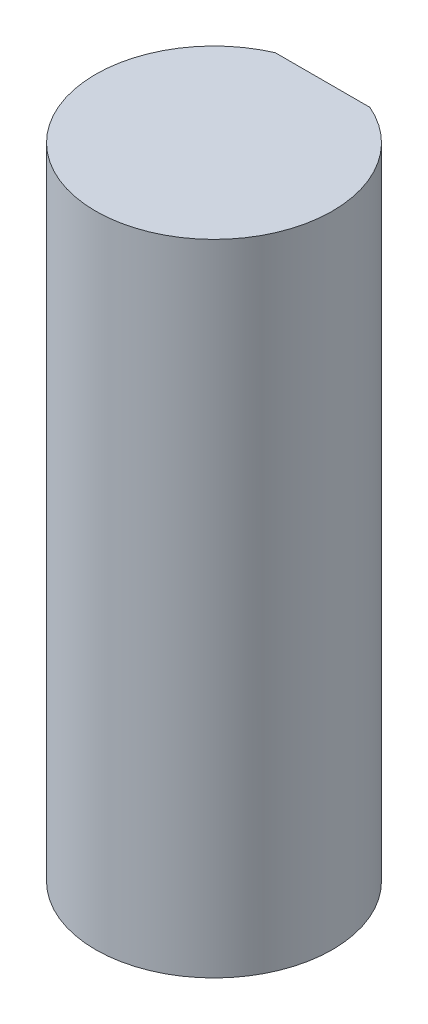
ISO-10303-21;
HEADER;
FILE_DESCRIPTION(('STEP AP214'),'2;1');
FILE_NAME('part.step','',(''),(''),'','','');
FILE_SCHEMA(('AUTOMOTIVE_DESIGN { 1 0 10303 214 1 1 1 1 }'));
ENDSEC;
DATA;
#1=APPLICATION_CONTEXT('core data for automotive mechanical design processes');
#2=APPLICATION_PROTOCOL_DEFINITION('international standard','automotive_design',2000,#1);
#3=PRODUCT_CONTEXT('',#1,'mechanical');
#4=PRODUCT('Part','Part','',(#3));
#5=PRODUCT_RELATED_PRODUCT_CATEGORY('part','',(#4));
#6=PRODUCT_DEFINITION_FORMATION('','',#4);
#7=PRODUCT_DEFINITION_CONTEXT('part definition',#1,'design');
#8=PRODUCT_DEFINITION('design','',#6,#7);
#9=PRODUCT_DEFINITION_SHAPE('','',#8);
#10=(LENGTH_UNIT() NAMED_UNIT(*) SI_UNIT(.MILLI.,.METRE.));
#11=(NAMED_UNIT(*) PLANE_ANGLE_UNIT() SI_UNIT($,.RADIAN.));
#12=(NAMED_UNIT(*) SI_UNIT($,.STERADIAN.) SOLID_ANGLE_UNIT());
#13=UNCERTAINTY_MEASURE_WITH_UNIT(LENGTH_MEASURE(1.E-05),#10,'distance_accuracy_value','');
#14=(GEOMETRIC_REPRESENTATION_CONTEXT(3) GLOBAL_UNCERTAINTY_ASSIGNED_CONTEXT((#13)) GLOBAL_UNIT_ASSIGNED_CONTEXT((#10,
#11,#12)) REPRESENTATION_CONTEXT('',''));
#15=CARTESIAN_POINT('',(0.,0.,0.));
#16=DIRECTION('',(0.,0.,1.));
#17=DIRECTION('',(1.,0.,0.));
#18=AXIS2_PLACEMENT_3D('',#15,#16,#17);
#19=CARTESIAN_POINT('',(0.,16.2,0.));
#20=DIRECTION('',(0.,-1.,0.));
#21=DIRECTION('',(0.,0.,-1.));
#22=AXIS2_PLACEMENT_3D('',#19,#20,#21);
#23=CYLINDRICAL_SURFACE('',#22,3.);
#24=CARTESIAN_POINT('',(0.,16.2,0.));
#25=DIRECTION('',(0.,1.,0.));
#26=DIRECTION('',(0.,0.,1.));
#27=AXIS2_PLACEMENT_3D('',#24,#25,#26);
#28=CIRCLE('',#27,3.);
#29=CARTESIAN_POINT('',(-1.19895788082818,16.2,-2.75));
#30=VERTEX_POINT('',#29);
#31=CARTESIAN_POINT('',(1.19895788082818,16.2,-2.75));
#32=VERTEX_POINT('',#31);
#33=EDGE_CURVE('E11',#30,#32,#28,.T.);
#34=ORIENTED_EDGE('',*,*,#33,.F.);
#35=DIRECTION('',(0.,1.,0.));
#36=VECTOR('',#35,1.);
#37=CARTESIAN_POINT('',(-1.19895788082818,4.2,-2.75));
#38=LINE('',#37,#36);
#39=CARTESIAN_POINT('',(-1.19895788082818,4.2,-2.75));
#40=VERTEX_POINT('',#39);
#41=EDGE_CURVE('E48',#40,#30,#38,.T.);
#42=ORIENTED_EDGE('',*,*,#41,.F.);
#43=CARTESIAN_POINT('',(0.,4.2,0.));
#44=DIRECTION('',(0.,1.,0.));
#45=DIRECTION('',(0.,0.,1.));
#46=AXIS2_PLACEMENT_3D('',#43,#44,#45);
#47=CIRCLE('',#46,3.);
#48=CARTESIAN_POINT('',(1.19895788082818,4.2,-2.75));
#49=VERTEX_POINT('',#48);
#50=EDGE_CURVE('E63',#49,#40,#47,.T.);
#51=ORIENTED_EDGE('',*,*,#50,.F.);
#52=DIRECTION('',(0.,1.,0.));
#53=VECTOR('',#52,1.);
#54=CARTESIAN_POINT('',(1.19895788082818,4.2,-2.75));
#55=LINE('',#54,#53);
#56=EDGE_CURVE('E54',#49,#32,#55,.T.);
#57=ORIENTED_EDGE('',*,*,#56,.T.);
#58=EDGE_LOOP('',(#34,#42,#51,#57));
#59=FACE_BOUND('',#58,.T.);
#60=CARTESIAN_POINT('',(0.,0.,0.));
#61=DIRECTION('',(0.,1.,0.));
#62=DIRECTION('',(0.,0.,1.));
#63=AXIS2_PLACEMENT_3D('',#60,#61,#62);
#64=CIRCLE('',#63,3.);
#65=CARTESIAN_POINT('',(0.,0.,3.));
#66=VERTEX_POINT('',#65);
#67=EDGE_CURVE('E37',#66,#66,#64,.T.);
#68=ORIENTED_EDGE('',*,*,#67,.T.);
#69=EDGE_LOOP('',(#68));
#70=FACE_BOUND('',#69,.T.);
#71=ADVANCED_FACE('F34',(#59,#70),#23,.T.);
#72=CARTESIAN_POINT('',(0.,16.2,0.));
#73=DIRECTION('',(0.,1.,0.));
#74=DIRECTION('',(0.,0.,1.));
#75=AXIS2_PLACEMENT_3D('',#72,#73,#74);
#76=PLANE('',#75);
#77=DIRECTION('',(1.,0.,0.));
#78=VECTOR('',#77,1.);
#79=CARTESIAN_POINT('',(-1.19895788082818,16.2,-2.75));
#80=LINE('',#79,#78);
#81=EDGE_CURVE('E59',#30,#32,#80,.T.);
#82=ORIENTED_EDGE('',*,*,#81,.F.);
#83=ORIENTED_EDGE('',*,*,#33,.T.);
#84=EDGE_LOOP('',(#82,#83));
#85=FACE_BOUND('',#84,.T.);
#86=ADVANCED_FACE('F69',(#85),#76,.T.);
#87=CARTESIAN_POINT('',(0.,0.,0.));
#88=DIRECTION('',(0.,1.,0.));
#89=DIRECTION('',(0.,0.,1.));
#90=AXIS2_PLACEMENT_3D('',#87,#88,#89);
#91=PLANE('',#90);
#92=ORIENTED_EDGE('',*,*,#67,.F.);
#93=EDGE_LOOP('',(#92));
#94=FACE_BOUND('',#93,.T.);
#95=ADVANCED_FACE('F71',(#94),#91,.F.);
#96=CARTESIAN_POINT('',(-1.19895788082818,4.2,-2.75));
#97=DIRECTION('',(0.,0.,1.));
#98=DIRECTION('',(1.,0.,0.));
#99=AXIS2_PLACEMENT_3D('',#96,#97,#98);
#100=PLANE('',#99);
#101=ORIENTED_EDGE('',*,*,#81,.T.);
#102=ORIENTED_EDGE('',*,*,#56,.F.);
#103=DIRECTION('',(1.,0.,0.));
#104=VECTOR('',#103,1.);
#105=CARTESIAN_POINT('',(-1.19895788082818,4.2,-2.75));
#106=LINE('',#105,#104);
#107=EDGE_CURVE('E86',#40,#49,#106,.T.);
#108=ORIENTED_EDGE('',*,*,#107,.F.);
#109=ORIENTED_EDGE('',*,*,#41,.T.);
#110=EDGE_LOOP('',(#101,#102,#108,#109));
#111=FACE_BOUND('',#110,.T.);
#112=ADVANCED_FACE('F60',(#111),#100,.F.);
#113=CARTESIAN_POINT('',(0.,4.2,0.));
#114=DIRECTION('',(0.,1.,0.));
#115=DIRECTION('',(0.,0.,1.));
#116=AXIS2_PLACEMENT_3D('',#113,#114,#115);
#117=PLANE('',#116);
#118=ORIENTED_EDGE('',*,*,#50,.T.);
#119=ORIENTED_EDGE('',*,*,#107,.T.);
#120=EDGE_LOOP('',(#118,#119));
#121=FACE_BOUND('',#120,.T.);
#122=ADVANCED_FACE('F81',(#121),#117,.T.);
#123=CLOSED_SHELL('',(#71,#86,#95,#112,#122));
#124=MANIFOLD_SOLID_BREP('B2',#123);
#125=ADVANCED_BREP_SHAPE_REPRESENTATION('',(#18,#124),#14);
#126=SHAPE_DEFINITION_REPRESENTATION(#9,#125);
ENDSEC;
END-ISO-10303-21;
